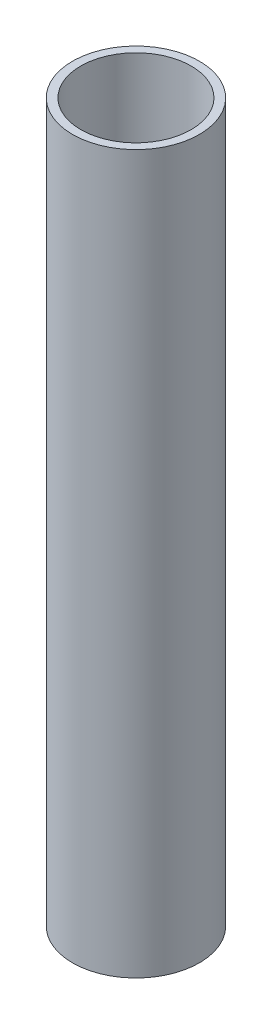
ISO-10303-21;
HEADER;
FILE_DESCRIPTION(('STEP AP214'),'2;1');
FILE_NAME('part.step','',(''),(''),'','','');
FILE_SCHEMA(('AUTOMOTIVE_DESIGN { 1 0 10303 214 1 1 1 1 }'));
ENDSEC;
DATA;
#1=APPLICATION_CONTEXT('core data for automotive mechanical design processes');
#2=APPLICATION_PROTOCOL_DEFINITION('international standard','automotive_design',2000,#1);
#3=PRODUCT_CONTEXT('',#1,'mechanical');
#4=PRODUCT('Part','Part','',(#3));
#5=PRODUCT_RELATED_PRODUCT_CATEGORY('part','',(#4));
#6=PRODUCT_DEFINITION_FORMATION('','',#4);
#7=PRODUCT_DEFINITION_CONTEXT('part definition',#1,'design');
#8=PRODUCT_DEFINITION('design','',#6,#7);
#9=PRODUCT_DEFINITION_SHAPE('','',#8);
#10=(LENGTH_UNIT() NAMED_UNIT(*) SI_UNIT(.MILLI.,.METRE.));
#11=(NAMED_UNIT(*) PLANE_ANGLE_UNIT() SI_UNIT($,.RADIAN.));
#12=(NAMED_UNIT(*) SI_UNIT($,.STERADIAN.) SOLID_ANGLE_UNIT());
#13=UNCERTAINTY_MEASURE_WITH_UNIT(LENGTH_MEASURE(1.E-05),#10,'distance_accuracy_value','');
#14=(GEOMETRIC_REPRESENTATION_CONTEXT(3) GLOBAL_UNCERTAINTY_ASSIGNED_CONTEXT((#13)) GLOBAL_UNIT_ASSIGNED_CONTEXT((#10,
#11,#12)) REPRESENTATION_CONTEXT('',''));
#15=CARTESIAN_POINT('',(0.,0.,0.));
#16=DIRECTION('',(0.,0.,1.));
#17=DIRECTION('',(1.,0.,0.));
#18=AXIS2_PLACEMENT_3D('',#15,#16,#17);
#19=CARTESIAN_POINT('',(0.,260.,0.));
#20=DIRECTION('',(0.,1.,0.));
#21=DIRECTION('',(0.,0.,1.));
#22=AXIS2_PLACEMENT_3D('',#19,#20,#21);
#23=PLANE('',#22);
#24=CARTESIAN_POINT('',(0.,260.,0.));
#25=DIRECTION('',(0.,1.,0.));
#26=DIRECTION('',(0.,0.,1.));
#27=AXIS2_PLACEMENT_3D('',#24,#25,#26);
#28=CIRCLE('',#27,23.);
#29=CARTESIAN_POINT('',(0.,260.,23.));
#30=VERTEX_POINT('',#29);
#31=EDGE_CURVE('E10',#30,#30,#28,.T.);
#32=ORIENTED_EDGE('',*,*,#31,.T.);
#33=EDGE_LOOP('',(#32));
#34=FACE_BOUND('',#33,.T.);
#35=CARTESIAN_POINT('',(0.,260.,0.));
#36=DIRECTION('',(0.,1.,0.));
#37=DIRECTION('',(0.,0.,1.));
#38=AXIS2_PLACEMENT_3D('',#35,#36,#37);
#39=CIRCLE('',#38,20.);
#40=CARTESIAN_POINT('',(0.,260.,20.));
#41=VERTEX_POINT('',#40);
#42=EDGE_CURVE('E52',#41,#41,#39,.T.);
#43=ORIENTED_EDGE('',*,*,#42,.F.);
#44=EDGE_LOOP('',(#43));
#45=FACE_BOUND('',#44,.T.);
#46=ADVANCED_FACE('F39',(#34,#45),#23,.T.);
#47=CARTESIAN_POINT('',(0.,0.,0.));
#48=DIRECTION('',(0.,1.,0.));
#49=DIRECTION('',(0.,0.,1.));
#50=AXIS2_PLACEMENT_3D('',#47,#48,#49);
#51=PLANE('',#50);
#52=CARTESIAN_POINT('',(0.,0.,0.));
#53=DIRECTION('',(0.,1.,0.));
#54=DIRECTION('',(0.,0.,1.));
#55=AXIS2_PLACEMENT_3D('',#52,#53,#54);
#56=CIRCLE('',#55,23.);
#57=CARTESIAN_POINT('',(0.,0.,23.));
#58=VERTEX_POINT('',#57);
#59=EDGE_CURVE('E43',#58,#58,#56,.T.);
#60=ORIENTED_EDGE('',*,*,#59,.F.);
#61=EDGE_LOOP('',(#60));
#62=FACE_BOUND('',#61,.T.);
#63=CARTESIAN_POINT('',(0.,0.,0.));
#64=DIRECTION('',(0.,1.,0.));
#65=DIRECTION('',(0.,0.,1.));
#66=AXIS2_PLACEMENT_3D('',#63,#64,#65);
#67=CIRCLE('',#66,20.);
#68=CARTESIAN_POINT('',(0.,0.,20.));
#69=VERTEX_POINT('',#68);
#70=EDGE_CURVE('E54',#69,#69,#67,.T.);
#71=ORIENTED_EDGE('',*,*,#70,.T.);
#72=EDGE_LOOP('',(#71));
#73=FACE_BOUND('',#72,.T.);
#74=ADVANCED_FACE('F66',(#62,#73),#51,.F.);
#75=CARTESIAN_POINT('',(0.,260.,0.));
#76=DIRECTION('',(0.,-1.,0.));
#77=DIRECTION('',(0.,0.,-1.));
#78=AXIS2_PLACEMENT_3D('',#75,#76,#77);
#79=CYLINDRICAL_SURFACE('',#78,23.);
#80=ORIENTED_EDGE('',*,*,#31,.F.);
#81=EDGE_LOOP('',(#80));
#82=FACE_BOUND('',#81,.T.);
#83=ORIENTED_EDGE('',*,*,#59,.T.);
#84=EDGE_LOOP('',(#83));
#85=FACE_BOUND('',#84,.T.);
#86=ADVANCED_FACE('F41',(#82,#85),#79,.T.);
#87=CARTESIAN_POINT('',(0.,260.,0.));
#88=DIRECTION('',(0.,-1.,0.));
#89=DIRECTION('',(0.,0.,-1.));
#90=AXIS2_PLACEMENT_3D('',#87,#88,#89);
#91=CYLINDRICAL_SURFACE('',#90,20.);
#92=ORIENTED_EDGE('',*,*,#42,.T.);
#93=EDGE_LOOP('',(#92));
#94=FACE_BOUND('',#93,.T.);
#95=ORIENTED_EDGE('',*,*,#70,.F.);
#96=EDGE_LOOP('',(#95));
#97=FACE_BOUND('',#96,.T.);
#98=ADVANCED_FACE('F62',(#94,#97),#91,.F.);
#99=CLOSED_SHELL('',(#46,#74,#86,#98));
#100=MANIFOLD_SOLID_BREP('B2',#99);
#101=ADVANCED_BREP_SHAPE_REPRESENTATION('',(#18,#100),#14);
#102=SHAPE_DEFINITION_REPRESENTATION(#9,#101);
ENDSEC;
END-ISO-10303-21;
